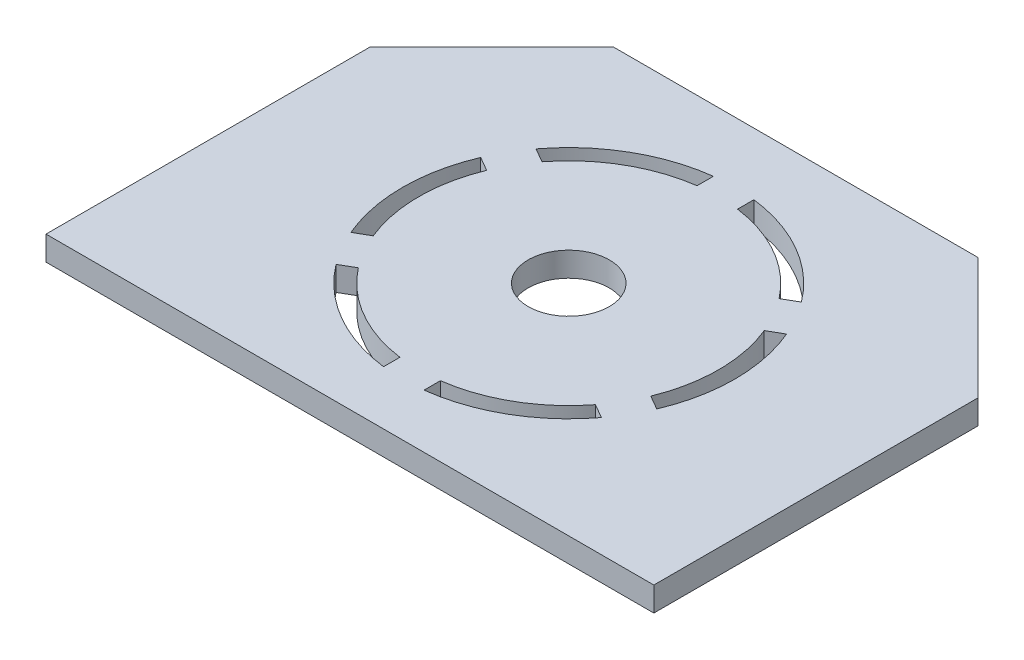
ISO-10303-21;
HEADER;
FILE_DESCRIPTION(('STEP AP214'),'2;1');
FILE_NAME('part.step','',(''),(''),'','','');
FILE_SCHEMA(('AUTOMOTIVE_DESIGN { 1 0 10303 214 1 1 1 1 }'));
ENDSEC;
DATA;
#1=APPLICATION_CONTEXT('core data for automotive mechanical design processes');
#2=APPLICATION_PROTOCOL_DEFINITION('international standard','automotive_design',2000,#1);
#3=PRODUCT_CONTEXT('',#1,'mechanical');
#4=PRODUCT('Part','Part','',(#3));
#5=PRODUCT_RELATED_PRODUCT_CATEGORY('part','',(#4));
#6=PRODUCT_DEFINITION_FORMATION('','',#4);
#7=PRODUCT_DEFINITION_CONTEXT('part definition',#1,'design');
#8=PRODUCT_DEFINITION('design','',#6,#7);
#9=PRODUCT_DEFINITION_SHAPE('','',#8);
#10=(LENGTH_UNIT() NAMED_UNIT(*) SI_UNIT(.MILLI.,.METRE.));
#11=(NAMED_UNIT(*) PLANE_ANGLE_UNIT() SI_UNIT($,.RADIAN.));
#12=(NAMED_UNIT(*) SI_UNIT($,.STERADIAN.) SOLID_ANGLE_UNIT());
#13=UNCERTAINTY_MEASURE_WITH_UNIT(LENGTH_MEASURE(1.E-05),#10,'distance_accuracy_value','');
#14=(GEOMETRIC_REPRESENTATION_CONTEXT(3) GLOBAL_UNCERTAINTY_ASSIGNED_CONTEXT((#13)) GLOBAL_UNIT_ASSIGNED_CONTEXT((#10,
#11,#12)) REPRESENTATION_CONTEXT('',''));
#15=CARTESIAN_POINT('',(0.,0.,0.));
#16=DIRECTION('',(0.,0.,1.));
#17=DIRECTION('',(1.,0.,0.));
#18=AXIS2_PLACEMENT_3D('',#15,#16,#17);
#19=CARTESIAN_POINT('',(20.5682593856655,3.,-26.1552901023891));
#20=DIRECTION('',(0.,-1.,0.));
#21=DIRECTION('',(0.,0.,-1.));
#22=AXIS2_PLACEMENT_3D('',#19,#20,#21);
#23=CYLINDRICAL_SURFACE('',#22,18.5);
#24=CARTESIAN_POINT('',(20.5682593856655,0.,-26.1552901023891));
#25=DIRECTION('',(0.,1.,0.));
#26=DIRECTION('',(0.,0.,1.));
#27=AXIS2_PLACEMENT_3D('',#24,#25,#26);
#28=CIRCLE('',#27,18.5);
#29=CARTESIAN_POINT('',(18.0682593856655,0.,-44.4855928822116));
#30=VERTEX_POINT('',#29);
#31=CARTESIAN_POINT('',(5.94375151927797,0.,-37.4855050017619));
#32=VERTEX_POINT('',#31);
#33=EDGE_CURVE('E60',#30,#32,#28,.T.);
#34=ORIENTED_EDGE('',*,*,#33,.T.);
#35=DIRECTION('',(0.,1.,0.));
#36=VECTOR('',#35,1.);
#37=CARTESIAN_POINT('',(5.94375151927854,0.,-37.4855050017614));
#38=LINE('',#37,#36);
#39=CARTESIAN_POINT('',(5.94375151927797,3.,-37.4855050017619));
#40=VERTEX_POINT('',#39);
#41=EDGE_CURVE('E81',#32,#40,#38,.T.);
#42=ORIENTED_EDGE('',*,*,#41,.T.);
#43=CARTESIAN_POINT('',(20.5682593856655,3.,-26.1552901023891));
#44=DIRECTION('',(0.,1.,0.));
#45=DIRECTION('',(0.,0.,1.));
#46=AXIS2_PLACEMENT_3D('',#43,#44,#45);
#47=CIRCLE('',#46,18.5);
#48=CARTESIAN_POINT('',(18.0682593856655,3.,-44.4855928822124));
#49=VERTEX_POINT('',#48);
#50=EDGE_CURVE('E12',#49,#40,#47,.T.);
#51=ORIENTED_EDGE('',*,*,#50,.F.);
#52=DIRECTION('',(0.,1.,0.));
#53=VECTOR('',#52,1.);
#54=CARTESIAN_POINT('',(18.0682593856655,0.,-44.4855928822116));
#55=LINE('',#54,#53);
#56=EDGE_CURVE('E457',#30,#49,#55,.T.);
#57=ORIENTED_EDGE('',*,*,#56,.F.);
#58=EDGE_LOOP('',(#34,#42,#51,#57));
#59=FACE_BOUND('',#58,.T.);
#60=ADVANCED_FACE('F56',(#59),#23,.T.);
#61=CARTESIAN_POINT('',(20.5682593856655,3.,-26.1552901023891));
#62=DIRECTION('',(0.,-1.,0.));
#63=DIRECTION('',(0.,0.,-1.));
#64=AXIS2_PLACEMENT_3D('',#61,#62,#63);
#65=CYLINDRICAL_SURFACE('',#64,20.5);
#66=DIRECTION('',(0.,1.,0.));
#67=VECTOR('',#66,1.);
#68=CARTESIAN_POINT('',(4.19724919895953,0.,-38.4938485865379));
#69=LINE('',#68,#67);
#70=CARTESIAN_POINT('',(4.19724919895953,0.,-38.4938485865379));
#71=VERTEX_POINT('',#70);
#72=CARTESIAN_POINT('',(4.19724919895953,3.,-38.4938485865379));
#73=VERTEX_POINT('',#72);
#74=EDGE_CURVE('E282',#71,#73,#69,.T.);
#75=ORIENTED_EDGE('',*,*,#74,.F.);
#76=CARTESIAN_POINT('',(20.5682593856655,0.,-26.1552901023891));
#77=DIRECTION('',(0.,1.,0.));
#78=DIRECTION('',(0.,0.,1.));
#79=AXIS2_PLACEMENT_3D('',#76,#77,#78);
#80=CIRCLE('',#79,20.5);
#81=CARTESIAN_POINT('',(18.0682593856655,0.,-46.5022800517649));
#82=VERTEX_POINT('',#81);
#83=EDGE_CURVE('E403',#82,#71,#80,.T.);
#84=ORIENTED_EDGE('',*,*,#83,.F.);
#85=DIRECTION('',(0.,1.,0.));
#86=VECTOR('',#85,1.);
#87=CARTESIAN_POINT('',(18.0682593856655,0.,-46.5022800517649));
#88=LINE('',#87,#86);
#89=CARTESIAN_POINT('',(18.0682593856655,3.,-46.5022800517649));
#90=VERTEX_POINT('',#89);
#91=EDGE_CURVE('E445',#82,#90,#88,.T.);
#92=ORIENTED_EDGE('',*,*,#91,.T.);
#93=CARTESIAN_POINT('',(20.5682593856655,3.,-26.1552901023891));
#94=DIRECTION('',(0.,1.,0.));
#95=DIRECTION('',(0.,0.,1.));
#96=AXIS2_PLACEMENT_3D('',#93,#94,#95);
#97=CIRCLE('',#96,20.5);
#98=EDGE_CURVE('E380',#90,#73,#97,.T.);
#99=ORIENTED_EDGE('',*,*,#98,.T.);
#100=EDGE_LOOP('',(#75,#84,#92,#99));
#101=FACE_BOUND('',#100,.T.);
#102=ADVANCED_FACE('F483',(#101),#65,.F.);
#103=CARTESIAN_POINT('',(3.44375151927794,3.,-33.1553779828396));
#104=VERTEX_POINT('',#103);
#105=CARTESIAN_POINT('',(3.44375151927797,3.,-19.1552022219385));
#106=VERTEX_POINT('',#105);
#107=EDGE_CURVE('E65',#104,#106,#47,.T.);
#108=ORIENTED_EDGE('',*,*,#107,.F.);
#109=DIRECTION('',(0.,1.,0.));
#110=VECTOR('',#109,1.);
#111=CARTESIAN_POINT('',(3.44375151927853,0.,-33.1553779828392));
#112=LINE('',#111,#110);
#113=CARTESIAN_POINT('',(3.44375151927853,0.,-33.1553779828392));
#114=VERTEX_POINT('',#113);
#115=EDGE_CURVE('E264',#114,#104,#112,.T.);
#116=ORIENTED_EDGE('',*,*,#115,.F.);
#117=CARTESIAN_POINT('',(3.44375151927797,0.,-19.1552022219385));
#118=VERTEX_POINT('',#117);
#119=EDGE_CURVE('E254',#114,#118,#28,.T.);
#120=ORIENTED_EDGE('',*,*,#119,.T.);
#121=DIRECTION('',(0.,1.,0.));
#122=VECTOR('',#121,1.);
#123=CARTESIAN_POINT('',(3.44375151927873,0.,-19.1552022219388));
#124=LINE('',#123,#122);
#125=EDGE_CURVE('E301',#118,#106,#124,.T.);
#126=ORIENTED_EDGE('',*,*,#125,.T.);
#127=EDGE_LOOP('',(#108,#116,#120,#126));
#128=FACE_BOUND('',#127,.T.);
#129=ADVANCED_FACE('F265',(#128),#23,.T.);
#130=DIRECTION('',(0.,1.,0.));
#131=VECTOR('',#130,1.);
#132=CARTESIAN_POINT('',(1.69724919895999,0.,-34.1637215676155));
#133=LINE('',#132,#131);
#134=CARTESIAN_POINT('',(1.69724919895939,0.,-34.1637215676158));
#135=VERTEX_POINT('',#134);
#136=CARTESIAN_POINT('',(1.69724919895999,3.,-34.1637215676155));
#137=VERTEX_POINT('',#136);
#138=EDGE_CURVE('E268',#135,#137,#133,.T.);
#139=ORIENTED_EDGE('',*,*,#138,.T.);
#140=CARTESIAN_POINT('',(1.69724919895965,3.,-18.1468586371623));
#141=VERTEX_POINT('',#140);
#142=EDGE_CURVE('E384',#137,#141,#97,.T.);
#143=ORIENTED_EDGE('',*,*,#142,.T.);
#144=DIRECTION('',(0.,1.,0.));
#145=VECTOR('',#144,1.);
#146=CARTESIAN_POINT('',(1.69724919895965,0.,-18.1468586371623));
#147=LINE('',#146,#145);
#148=CARTESIAN_POINT('',(1.69724919895965,0.,-18.1468586371623));
#149=VERTEX_POINT('',#148);
#150=EDGE_CURVE('E297',#149,#141,#147,.T.);
#151=ORIENTED_EDGE('',*,*,#150,.F.);
#152=EDGE_CURVE('E407',#135,#149,#80,.T.);
#153=ORIENTED_EDGE('',*,*,#152,.F.);
#154=EDGE_LOOP('',(#139,#143,#151,#153));
#155=FACE_BOUND('',#154,.T.);
#156=ADVANCED_FACE('F512',(#155),#65,.F.);
#157=CARTESIAN_POINT('',(5.94375151927801,3.,-14.8250752030163));
#158=VERTEX_POINT('',#157);
#159=CARTESIAN_POINT('',(18.0682593856655,3.,-7.82498732256572));
#160=VERTEX_POINT('',#159);
#161=EDGE_CURVE('E551',#158,#160,#47,.T.);
#162=ORIENTED_EDGE('',*,*,#161,.F.);
#163=DIRECTION('',(0.,1.,0.));
#164=VECTOR('',#163,1.);
#165=CARTESIAN_POINT('',(5.94375151927872,0.,-14.8250752030167));
#166=LINE('',#165,#164);
#167=CARTESIAN_POINT('',(5.94375151927872,0.,-14.8250752030167));
#168=VERTEX_POINT('',#167);
#169=EDGE_CURVE('E303',#168,#158,#166,.T.);
#170=ORIENTED_EDGE('',*,*,#169,.F.);
#171=CARTESIAN_POINT('',(18.0682593856655,0.,-7.82498732256572));
#172=VERTEX_POINT('',#171);
#173=EDGE_CURVE('E263',#168,#172,#28,.T.);
#174=ORIENTED_EDGE('',*,*,#173,.T.);
#175=DIRECTION('',(0.,1.,0.));
#176=VECTOR('',#175,1.);
#177=CARTESIAN_POINT('',(18.0682593856656,0.,-7.82498732256652));
#178=LINE('',#177,#176);
#179=EDGE_CURVE('E324',#172,#160,#178,.T.);
#180=ORIENTED_EDGE('',*,*,#179,.T.);
#181=EDGE_LOOP('',(#162,#170,#174,#180));
#182=FACE_BOUND('',#181,.T.);
#183=ADVANCED_FACE('F516',(#182),#23,.T.);
#184=DIRECTION('',(0.,1.,0.));
#185=VECTOR('',#184,1.);
#186=CARTESIAN_POINT('',(4.19724919895968,0.,-13.8167316182401));
#187=LINE('',#186,#185);
#188=CARTESIAN_POINT('',(4.19724919895949,0.,-13.81673161824));
#189=VERTEX_POINT('',#188);
#190=CARTESIAN_POINT('',(4.19724919895968,3.,-13.8167316182401));
#191=VERTEX_POINT('',#190);
#192=EDGE_CURVE('E292',#189,#191,#187,.T.);
#193=ORIENTED_EDGE('',*,*,#192,.T.);
#194=CARTESIAN_POINT('',(18.0682593856656,3.,-5.80830015301347));
#195=VERTEX_POINT('',#194);
#196=EDGE_CURVE('E561',#191,#195,#97,.T.);
#197=ORIENTED_EDGE('',*,*,#196,.T.);
#198=DIRECTION('',(0.,1.,0.));
#199=VECTOR('',#198,1.);
#200=CARTESIAN_POINT('',(18.0682593856656,0.,-5.80830015301347));
#201=LINE('',#200,#199);
#202=CARTESIAN_POINT('',(18.0682593856656,0.,-5.80830015301347));
#203=VERTEX_POINT('',#202);
#204=EDGE_CURVE('E320',#203,#195,#201,.T.);
#205=ORIENTED_EDGE('',*,*,#204,.F.);
#206=EDGE_CURVE('E586',#189,#203,#80,.T.);
#207=ORIENTED_EDGE('',*,*,#206,.F.);
#208=EDGE_LOOP('',(#193,#197,#205,#207));
#209=FACE_BOUND('',#208,.T.);
#210=ADVANCED_FACE('F537',(#209),#65,.F.);
#211=CARTESIAN_POINT('',(23.0682593856656,3.,-7.82498732256572));
#212=VERTEX_POINT('',#211);
#213=CARTESIAN_POINT('',(35.1927672520531,3.,-14.8250752030163));
#214=VERTEX_POINT('',#213);
#215=EDGE_CURVE('E555',#212,#214,#47,.T.);
#216=ORIENTED_EDGE('',*,*,#215,.F.);
#217=DIRECTION('',(0.,1.,0.));
#218=VECTOR('',#217,1.);
#219=CARTESIAN_POINT('',(23.0682593856656,0.,-7.82498732256654));
#220=LINE('',#219,#218);
#221=CARTESIAN_POINT('',(23.0682593856656,0.,-7.82498732256654));
#222=VERTEX_POINT('',#221);
#223=EDGE_CURVE('E327',#222,#212,#220,.T.);
#224=ORIENTED_EDGE('',*,*,#223,.F.);
#225=CARTESIAN_POINT('',(35.1927672520531,0.,-14.8250752030163));
#226=VERTEX_POINT('',#225);
#227=EDGE_CURVE('E472',#222,#226,#28,.T.);
#228=ORIENTED_EDGE('',*,*,#227,.T.);
#229=DIRECTION('',(0.,1.,0.));
#230=VECTOR('',#229,1.);
#231=CARTESIAN_POINT('',(35.1927672520524,0.,-14.8250752030168));
#232=LINE('',#231,#230);
#233=EDGE_CURVE('E348',#226,#214,#232,.T.);
#234=ORIENTED_EDGE('',*,*,#233,.T.);
#235=EDGE_LOOP('',(#216,#224,#228,#234));
#236=FACE_BOUND('',#235,.T.);
#237=ADVANCED_FACE('F531',(#236),#23,.T.);
#238=DIRECTION('',(0.,1.,0.));
#239=VECTOR('',#238,1.);
#240=CARTESIAN_POINT('',(23.0682593856656,0.,-5.80830015301349));
#241=LINE('',#240,#239);
#242=CARTESIAN_POINT('',(23.0682593856656,0.,-5.80830015301328));
#243=VERTEX_POINT('',#242);
#244=CARTESIAN_POINT('',(23.0682593856656,3.,-5.80830015301349));
#245=VERTEX_POINT('',#244);
#246=EDGE_CURVE('E315',#243,#245,#241,.T.);
#247=ORIENTED_EDGE('',*,*,#246,.T.);
#248=CARTESIAN_POINT('',(36.9392695723715,3.,-13.8167316182403));
#249=VERTEX_POINT('',#248);
#250=EDGE_CURVE('E563',#245,#249,#97,.T.);
#251=ORIENTED_EDGE('',*,*,#250,.T.);
#252=DIRECTION('',(0.,1.,0.));
#253=VECTOR('',#252,1.);
#254=CARTESIAN_POINT('',(36.9392695723715,0.,-13.8167316182403));
#255=LINE('',#254,#253);
#256=CARTESIAN_POINT('',(36.9392695723715,0.,-13.8167316182403));
#257=VERTEX_POINT('',#256);
#258=EDGE_CURVE('E344',#257,#249,#255,.T.);
#259=ORIENTED_EDGE('',*,*,#258,.F.);
#260=EDGE_CURVE('E582',#243,#257,#80,.T.);
#261=ORIENTED_EDGE('',*,*,#260,.F.);
#262=EDGE_LOOP('',(#247,#251,#259,#261));
#263=FACE_BOUND('',#262,.T.);
#264=ADVANCED_FACE('F529',(#263),#65,.F.);
#265=CARTESIAN_POINT('',(37.6927672520531,3.,-19.1552022219385));
#266=VERTEX_POINT('',#265);
#267=CARTESIAN_POINT('',(37.6927672520531,3.,-33.1553779828397));
#268=VERTEX_POINT('',#267);
#269=EDGE_CURVE('E577',#266,#268,#47,.T.);
#270=ORIENTED_EDGE('',*,*,#269,.F.);
#271=DIRECTION('',(0.,1.,0.));
#272=VECTOR('',#271,1.);
#273=CARTESIAN_POINT('',(37.6927672520524,0.,-19.1552022219389));
#274=LINE('',#273,#272);
#275=CARTESIAN_POINT('',(37.6927672520524,0.,-19.1552022219389));
#276=VERTEX_POINT('',#275);
#277=EDGE_CURVE('E351',#276,#266,#274,.T.);
#278=ORIENTED_EDGE('',*,*,#277,.F.);
#279=CARTESIAN_POINT('',(37.6927672520531,0.,-33.1553779828397));
#280=VERTEX_POINT('',#279);
#281=EDGE_CURVE('E468',#276,#280,#28,.T.);
#282=ORIENTED_EDGE('',*,*,#281,.T.);
#283=DIRECTION('',(0.,1.,0.));
#284=VECTOR('',#283,1.);
#285=CARTESIAN_POINT('',(37.6927672520523,0.,-33.1553779828393));
#286=LINE('',#285,#284);
#287=EDGE_CURVE('E372',#280,#268,#286,.T.);
#288=ORIENTED_EDGE('',*,*,#287,.T.);
#289=EDGE_LOOP('',(#270,#278,#282,#288));
#290=FACE_BOUND('',#289,.T.);
#291=ADVANCED_FACE('F518',(#290),#23,.T.);
#292=DIRECTION('',(0.,1.,0.));
#293=VECTOR('',#292,1.);
#294=CARTESIAN_POINT('',(39.4392695723715,0.,-18.1468586371625));
#295=LINE('',#294,#293);
#296=CARTESIAN_POINT('',(39.4392695723717,0.,-18.1468586371624));
#297=VERTEX_POINT('',#296);
#298=CARTESIAN_POINT('',(39.4392695723715,3.,-18.1468586371625));
#299=VERTEX_POINT('',#298);
#300=EDGE_CURVE('E339',#297,#299,#295,.T.);
#301=ORIENTED_EDGE('',*,*,#300,.T.);
#302=CARTESIAN_POINT('',(39.4392695723716,3.,-34.163721567616));
#303=VERTEX_POINT('',#302);
#304=EDGE_CURVE('E564',#299,#303,#97,.T.);
#305=ORIENTED_EDGE('',*,*,#304,.T.);
#306=DIRECTION('',(0.,1.,0.));
#307=VECTOR('',#306,1.);
#308=CARTESIAN_POINT('',(39.4392695723714,0.,-34.1637215676159));
#309=LINE('',#308,#307);
#310=CARTESIAN_POINT('',(39.4392695723716,0.,-34.163721567616));
#311=VERTEX_POINT('',#310);
#312=EDGE_CURVE('E368',#311,#303,#309,.T.);
#313=ORIENTED_EDGE('',*,*,#312,.F.);
#314=EDGE_CURVE('E581',#297,#311,#80,.T.);
#315=ORIENTED_EDGE('',*,*,#314,.F.);
#316=EDGE_LOOP('',(#301,#305,#313,#315));
#317=FACE_BOUND('',#316,.T.);
#318=ADVANCED_FACE('F526',(#317),#65,.F.);
#319=CARTESIAN_POINT('',(20.5682593856655,3.,-26.1552901023891));
#320=DIRECTION('',(0.,-1.,0.));
#321=DIRECTION('',(0.,0.,-1.));
#322=AXIS2_PLACEMENT_3D('',#319,#320,#321);
#323=CYLINDRICAL_SURFACE('',#322,5.);
#324=CARTESIAN_POINT('',(20.5682593856655,3.,-26.1552901023891));
#325=DIRECTION('',(0.,1.,0.));
#326=DIRECTION('',(0.,0.,1.));
#327=AXIS2_PLACEMENT_3D('',#324,#325,#326);
#328=CIRCLE('',#327,5.);
#329=CARTESIAN_POINT('',(20.5682593856655,3.,-21.1552901023891));
#330=VERTEX_POINT('',#329);
#331=EDGE_CURVE('E462',#330,#330,#328,.T.);
#332=ORIENTED_EDGE('',*,*,#331,.T.);
#333=EDGE_LOOP('',(#332));
#334=FACE_BOUND('',#333,.T.);
#335=CARTESIAN_POINT('',(20.5682593856655,0.,-26.1552901023891));
#336=DIRECTION('',(0.,1.,0.));
#337=DIRECTION('',(0.,0.,1.));
#338=AXIS2_PLACEMENT_3D('',#335,#336,#337);
#339=CIRCLE('',#338,5.);
#340=CARTESIAN_POINT('',(20.5682593856655,0.,-21.1552901023891));
#341=VERTEX_POINT('',#340);
#342=EDGE_CURVE('E453',#341,#341,#339,.T.);
#343=ORIENTED_EDGE('',*,*,#342,.F.);
#344=EDGE_LOOP('',(#343));
#345=FACE_BOUND('',#344,.T.);
#346=ADVANCED_FACE('F58',(#334,#345),#323,.F.);
#347=CARTESIAN_POINT('',(35.192767252053,3.,-37.4855050017619));
#348=VERTEX_POINT('',#347);
#349=CARTESIAN_POINT('',(23.0682593856655,3.,-44.4855928822124));
#350=VERTEX_POINT('',#349);
#351=EDGE_CURVE('E67',#348,#350,#47,.T.);
#352=ORIENTED_EDGE('',*,*,#351,.F.);
#353=DIRECTION('',(0.,1.,0.));
#354=VECTOR('',#353,1.);
#355=CARTESIAN_POINT('',(35.1927672520523,0.,-37.4855050017615));
#356=LINE('',#355,#354);
#357=CARTESIAN_POINT('',(35.1927672520523,0.,-37.4855050017615));
#358=VERTEX_POINT('',#357);
#359=EDGE_CURVE('E375',#358,#348,#356,.T.);
#360=ORIENTED_EDGE('',*,*,#359,.F.);
#361=CARTESIAN_POINT('',(23.0682593856655,0.,-44.4855928822124));
#362=VERTEX_POINT('',#361);
#363=EDGE_CURVE('E465',#358,#362,#28,.T.);
#364=ORIENTED_EDGE('',*,*,#363,.T.);
#365=DIRECTION('',(0.,1.,0.));
#366=VECTOR('',#365,1.);
#367=CARTESIAN_POINT('',(23.0682593856654,0.,-44.4855928822116));
#368=LINE('',#367,#366);
#369=EDGE_CURVE('E454',#362,#350,#368,.T.);
#370=ORIENTED_EDGE('',*,*,#369,.T.);
#371=EDGE_LOOP('',(#352,#360,#364,#370));
#372=FACE_BOUND('',#371,.T.);
#373=ADVANCED_FACE('F506',(#372),#23,.T.);
#374=CARTESIAN_POINT('',(0.,3.,0.));
#375=DIRECTION('',(0.,1.,0.));
#376=DIRECTION('',(0.,0.,1.));
#377=AXIS2_PLACEMENT_3D('',#374,#375,#376);
#378=PLANE('',#377);
#379=ORIENTED_EDGE('',*,*,#142,.F.);
#380=DIRECTION('',(0.866025403784436,0.,0.500000000000005));
#381=VECTOR('',#380,1.);
#382=CARTESIAN_POINT('',(3.44375151927853,3.,-33.1553779828392));
#383=LINE('',#382,#381);
#384=EDGE_CURVE('E278',#137,#104,#383,.T.);
#385=ORIENTED_EDGE('',*,*,#384,.T.);
#386=ORIENTED_EDGE('',*,*,#107,.T.);
#387=DIRECTION('',(-0.866025403784438,0.,0.500000000000001));
#388=VECTOR('',#387,1.);
#389=CARTESIAN_POINT('',(3.44375151927873,3.,-19.1552022219388));
#390=LINE('',#389,#388);
#391=EDGE_CURVE('E290',#106,#141,#390,.T.);
#392=ORIENTED_EDGE('',*,*,#391,.T.);
#393=EDGE_LOOP('',(#379,#385,#386,#392));
#394=FACE_BOUND('',#393,.T.);
#395=ORIENTED_EDGE('',*,*,#196,.F.);
#396=DIRECTION('',(0.866025403784424,0.,-0.500000000000026));
#397=VECTOR('',#396,1.);
#398=CARTESIAN_POINT('',(5.94375151927872,3.,-14.8250752030167));
#399=LINE('',#398,#397);
#400=EDGE_CURVE('E284',#191,#158,#399,.T.);
#401=ORIENTED_EDGE('',*,*,#400,.T.);
#402=ORIENTED_EDGE('',*,*,#161,.T.);
#403=DIRECTION('',(0.,0.,1.));
#404=VECTOR('',#403,1.);
#405=CARTESIAN_POINT('',(18.0682593856656,3.,-7.82498732256653));
#406=LINE('',#405,#404);
#407=EDGE_CURVE('E312',#160,#195,#406,.T.);
#408=ORIENTED_EDGE('',*,*,#407,.T.);
#409=EDGE_LOOP('',(#395,#401,#402,#408));
#410=FACE_BOUND('',#409,.T.);
#411=ORIENTED_EDGE('',*,*,#250,.F.);
#412=DIRECTION('',(0.,0.,-1.));
#413=VECTOR('',#412,1.);
#414=CARTESIAN_POINT('',(23.0682593856656,3.,-7.82498732256654));
#415=LINE('',#414,#413);
#416=EDGE_CURVE('E300',#245,#212,#415,.T.);
#417=ORIENTED_EDGE('',*,*,#416,.T.);
#418=ORIENTED_EDGE('',*,*,#215,.T.);
#419=DIRECTION('',(0.866025403784439,0.,0.5));
#420=VECTOR('',#419,1.);
#421=CARTESIAN_POINT('',(35.1927672520524,3.,-14.8250752030168));
#422=LINE('',#421,#420);
#423=EDGE_CURVE('E336',#214,#249,#422,.T.);
#424=ORIENTED_EDGE('',*,*,#423,.T.);
#425=EDGE_LOOP('',(#411,#417,#418,#424));
#426=FACE_BOUND('',#425,.T.);
#427=ORIENTED_EDGE('',*,*,#304,.F.);
#428=DIRECTION('',(-0.866025403784452,0.,-0.499999999999976));
#429=VECTOR('',#428,1.);
#430=CARTESIAN_POINT('',(37.6927672520524,3.,-19.1552022219389));
#431=LINE('',#430,#429);
#432=EDGE_CURVE('E323',#299,#266,#431,.T.);
#433=ORIENTED_EDGE('',*,*,#432,.T.);
#434=ORIENTED_EDGE('',*,*,#269,.T.);
#435=DIRECTION('',(0.866025403784438,0.,-0.500000000000002));
#436=VECTOR('',#435,1.);
#437=CARTESIAN_POINT('',(37.6927672520523,3.,-33.1553779828393));
#438=LINE('',#437,#436);
#439=EDGE_CURVE('E360',#268,#303,#438,.T.);
#440=ORIENTED_EDGE('',*,*,#439,.T.);
#441=EDGE_LOOP('',(#427,#433,#434,#440));
#442=FACE_BOUND('',#441,.T.);
#443=ORIENTED_EDGE('',*,*,#50,.T.);
#444=DIRECTION('',(-0.866025403784444,0.,-0.499999999999991));
#445=VECTOR('',#444,1.);
#446=CARTESIAN_POINT('',(5.94375151927857,3.,-37.4855050017614));
#447=LINE('',#446,#445);
#448=EDGE_CURVE('E274',#40,#73,#447,.T.);
#449=ORIENTED_EDGE('',*,*,#448,.T.);
#450=ORIENTED_EDGE('',*,*,#98,.F.);
#451=DIRECTION('',(0.,0.,1.));
#452=VECTOR('',#451,1.);
#453=CARTESIAN_POINT('',(18.0682593856655,3.,-44.4855928822116));
#454=LINE('',#453,#452);
#455=EDGE_CURVE('E437',#90,#49,#454,.T.);
#456=ORIENTED_EDGE('',*,*,#455,.T.);
#457=EDGE_LOOP('',(#443,#449,#450,#456));
#458=FACE_BOUND('',#457,.T.);
#459=ORIENTED_EDGE('',*,*,#331,.F.);
#460=EDGE_LOOP('',(#459));
#461=FACE_BOUND('',#460,.T.);
#462=DIRECTION('',(-0.866025403784425,0.,0.500000000000023));
#463=VECTOR('',#462,1.);
#464=CARTESIAN_POINT('',(35.1927672520523,3.,-37.4855050017615));
#465=LINE('',#464,#463);
#466=CARTESIAN_POINT('',(36.9392695723714,3.,-38.493848586538));
#467=VERTEX_POINT('',#466);
#468=EDGE_CURVE('E347',#467,#348,#465,.T.);
#469=ORIENTED_EDGE('',*,*,#468,.T.);
#470=ORIENTED_EDGE('',*,*,#351,.T.);
#471=DIRECTION('',(0.,0.,-1.));
#472=VECTOR('',#471,1.);
#473=CARTESIAN_POINT('',(23.0682593856654,3.,-44.4855928822116));
#474=LINE('',#473,#472);
#475=CARTESIAN_POINT('',(23.0682593856655,3.,-46.5022800517649));
#476=VERTEX_POINT('',#475);
#477=EDGE_CURVE('E442',#350,#476,#474,.T.);
#478=ORIENTED_EDGE('',*,*,#477,.T.);
#479=EDGE_CURVE('E385',#467,#476,#97,.T.);
#480=ORIENTED_EDGE('',*,*,#479,.F.);
#481=EDGE_LOOP('',(#469,#470,#478,#480));
#482=FACE_BOUND('',#481,.T.);
#483=DIRECTION('',(0.707106781186548,0.,0.707106781186548));
#484=VECTOR('',#483,1.);
#485=CARTESIAN_POINT('',(48.6117747440273,3.,-48.6117747440273));
#486=LINE('',#485,#484);
#487=CARTESIAN_POINT('',(43.0682593856655,3.,-54.1552901023891));
#488=VERTEX_POINT('',#487);
#489=CARTESIAN_POINT('',(58.0682593856655,3.,-39.1552901023891));
#490=VERTEX_POINT('',#489);
#491=EDGE_CURVE('E383',#488,#490,#486,.T.);
#492=ORIENTED_EDGE('',*,*,#491,.F.);
#493=DIRECTION('',(1.,0.,0.));
#494=VECTOR('',#493,1.);
#495=CARTESIAN_POINT('',(0.,3.,-54.1552901023891));
#496=LINE('',#495,#494);
#497=CARTESIAN_POINT('',(-1.93174061433449,3.,-54.1552901023891));
#498=VERTEX_POINT('',#497);
#499=EDGE_CURVE('E388',#498,#488,#496,.T.);
#500=ORIENTED_EDGE('',*,*,#499,.F.);
#501=DIRECTION('',(0.707106781186547,0.,-0.707106781186548));
#502=VECTOR('',#501,1.);
#503=CARTESIAN_POINT('',(-28.0435153583618,3.,-28.0435153583618));
#504=LINE('',#503,#502);
#505=CARTESIAN_POINT('',(-16.9317406143345,3.,-39.1552901023891));
#506=VERTEX_POINT('',#505);
#507=EDGE_CURVE('E391',#506,#498,#504,.T.);
#508=ORIENTED_EDGE('',*,*,#507,.F.);
#509=DIRECTION('',(0.,0.,1.));
#510=VECTOR('',#509,1.);
#511=CARTESIAN_POINT('',(-16.9317406143345,3.,0.));
#512=LINE('',#511,#510);
#513=CARTESIAN_POINT('',(-16.9317406143345,3.,0.844709897610922));
#514=VERTEX_POINT('',#513);
#515=EDGE_CURVE('E394',#506,#514,#512,.T.);
#516=ORIENTED_EDGE('',*,*,#515,.T.);
#517=DIRECTION('',(1.,0.,0.));
#518=VECTOR('',#517,1.);
#519=CARTESIAN_POINT('',(0.,3.,0.844709897610922));
#520=LINE('',#519,#518);
#521=CARTESIAN_POINT('',(58.0682593856655,3.,0.844709897610922));
#522=VERTEX_POINT('',#521);
#523=EDGE_CURVE('E397',#514,#522,#520,.T.);
#524=ORIENTED_EDGE('',*,*,#523,.T.);
#525=DIRECTION('',(0.,0.,1.));
#526=VECTOR('',#525,1.);
#527=CARTESIAN_POINT('',(58.0682593856655,3.,0.));
#528=LINE('',#527,#526);
#529=EDGE_CURVE('E399',#490,#522,#528,.T.);
#530=ORIENTED_EDGE('',*,*,#529,.F.);
#531=EDGE_LOOP('',(#492,#500,#508,#516,#524,#530));
#532=FACE_BOUND('',#531,.T.);
#533=ADVANCED_FACE('F486',(#394,#410,#426,#442,#458,#461,#482,#532),#378,.T.);
#534=CARTESIAN_POINT('',(0.,0.,0.));
#535=DIRECTION('',(0.,1.,0.));
#536=DIRECTION('',(0.,0.,1.));
#537=AXIS2_PLACEMENT_3D('',#534,#535,#536);
#538=PLANE('',#537);
#539=DIRECTION('',(0.866025403784436,0.,0.500000000000005));
#540=VECTOR('',#539,1.);
#541=CARTESIAN_POINT('',(3.44375151927853,0.,-33.1553779828392));
#542=LINE('',#541,#540);
#543=EDGE_CURVE('E258',#135,#114,#542,.T.);
#544=ORIENTED_EDGE('',*,*,#543,.F.);
#545=ORIENTED_EDGE('',*,*,#152,.T.);
#546=DIRECTION('',(-0.866025403784438,0.,0.500000000000001));
#547=VECTOR('',#546,1.);
#548=CARTESIAN_POINT('',(3.44375151927873,0.,-19.1552022219388));
#549=LINE('',#548,#547);
#550=EDGE_CURVE('E261',#118,#149,#549,.T.);
#551=ORIENTED_EDGE('',*,*,#550,.F.);
#552=ORIENTED_EDGE('',*,*,#119,.F.);
#553=EDGE_LOOP('',(#544,#545,#551,#552));
#554=FACE_BOUND('',#553,.T.);
#555=DIRECTION('',(0.866025403784424,0.,-0.500000000000026));
#556=VECTOR('',#555,1.);
#557=CARTESIAN_POINT('',(5.94375151927872,0.,-14.8250752030167));
#558=LINE('',#557,#556);
#559=EDGE_CURVE('E287',#189,#168,#558,.T.);
#560=ORIENTED_EDGE('',*,*,#559,.F.);
#561=ORIENTED_EDGE('',*,*,#206,.T.);
#562=DIRECTION('',(0.,0.,1.));
#563=VECTOR('',#562,1.);
#564=CARTESIAN_POINT('',(18.0682593856656,0.,-7.82498732256653));
#565=LINE('',#564,#563);
#566=EDGE_CURVE('E311',#172,#203,#565,.T.);
#567=ORIENTED_EDGE('',*,*,#566,.F.);
#568=ORIENTED_EDGE('',*,*,#173,.F.);
#569=EDGE_LOOP('',(#560,#561,#567,#568));
#570=FACE_BOUND('',#569,.T.);
#571=DIRECTION('',(0.,0.,-1.));
#572=VECTOR('',#571,1.);
#573=CARTESIAN_POINT('',(23.0682593856656,0.,-7.82498732256654));
#574=LINE('',#573,#572);
#575=EDGE_CURVE('E308',#243,#222,#574,.T.);
#576=ORIENTED_EDGE('',*,*,#575,.F.);
#577=ORIENTED_EDGE('',*,*,#260,.T.);
#578=DIRECTION('',(0.866025403784439,0.,0.5));
#579=VECTOR('',#578,1.);
#580=CARTESIAN_POINT('',(35.1927672520524,0.,-14.8250752030168));
#581=LINE('',#580,#579);
#582=EDGE_CURVE('E335',#226,#257,#581,.T.);
#583=ORIENTED_EDGE('',*,*,#582,.F.);
#584=ORIENTED_EDGE('',*,*,#227,.F.);
#585=EDGE_LOOP('',(#576,#577,#583,#584));
#586=FACE_BOUND('',#585,.T.);
#587=DIRECTION('',(-0.866025403784452,0.,-0.499999999999976));
#588=VECTOR('',#587,1.);
#589=CARTESIAN_POINT('',(37.6927672520524,0.,-19.1552022219389));
#590=LINE('',#589,#588);
#591=EDGE_CURVE('E332',#297,#276,#590,.T.);
#592=ORIENTED_EDGE('',*,*,#591,.F.);
#593=ORIENTED_EDGE('',*,*,#314,.T.);
#594=DIRECTION('',(0.866025403784438,0.,-0.500000000000002));
#595=VECTOR('',#594,1.);
#596=CARTESIAN_POINT('',(37.6927672520523,0.,-33.1553779828393));
#597=LINE('',#596,#595);
#598=EDGE_CURVE('E359',#280,#311,#597,.T.);
#599=ORIENTED_EDGE('',*,*,#598,.F.);
#600=ORIENTED_EDGE('',*,*,#281,.F.);
#601=EDGE_LOOP('',(#592,#593,#599,#600));
#602=FACE_BOUND('',#601,.T.);
#603=ORIENTED_EDGE('',*,*,#83,.T.);
#604=DIRECTION('',(-0.866025403784444,0.,-0.499999999999991));
#605=VECTOR('',#604,1.);
#606=CARTESIAN_POINT('',(5.94375151927857,0.,-37.4855050017614));
#607=LINE('',#606,#605);
#608=EDGE_CURVE('E273',#32,#71,#607,.T.);
#609=ORIENTED_EDGE('',*,*,#608,.F.);
#610=ORIENTED_EDGE('',*,*,#33,.F.);
#611=DIRECTION('',(0.,0.,1.));
#612=VECTOR('',#611,1.);
#613=CARTESIAN_POINT('',(18.0682593856655,0.,-44.4855928822116));
#614=LINE('',#613,#612);
#615=EDGE_CURVE('E438',#82,#30,#614,.T.);
#616=ORIENTED_EDGE('',*,*,#615,.F.);
#617=EDGE_LOOP('',(#603,#609,#610,#616));
#618=FACE_BOUND('',#617,.T.);
#619=ORIENTED_EDGE('',*,*,#342,.T.);
#620=EDGE_LOOP('',(#619));
#621=FACE_BOUND('',#620,.T.);
#622=ORIENTED_EDGE('',*,*,#363,.F.);
#623=DIRECTION('',(-0.866025403784425,0.,0.500000000000023));
#624=VECTOR('',#623,1.);
#625=CARTESIAN_POINT('',(35.1927672520523,0.,-37.4855050017615));
#626=LINE('',#625,#624);
#627=CARTESIAN_POINT('',(36.9392695723715,0.,-38.4938485865382));
#628=VERTEX_POINT('',#627);
#629=EDGE_CURVE('E356',#628,#358,#626,.T.);
#630=ORIENTED_EDGE('',*,*,#629,.F.);
#631=CARTESIAN_POINT('',(23.0682593856655,0.,-46.5022800517649));
#632=VERTEX_POINT('',#631);
#633=EDGE_CURVE('E371',#628,#632,#80,.T.);
#634=ORIENTED_EDGE('',*,*,#633,.T.);
#635=DIRECTION('',(0.,0.,-1.));
#636=VECTOR('',#635,1.);
#637=CARTESIAN_POINT('',(23.0682593856654,0.,-44.4855928822116));
#638=LINE('',#637,#636);
#639=EDGE_CURVE('E441',#362,#632,#638,.T.);
#640=ORIENTED_EDGE('',*,*,#639,.F.);
#641=EDGE_LOOP('',(#622,#630,#634,#640));
#642=FACE_BOUND('',#641,.T.);
#643=DIRECTION('',(0.707106781186548,0.,0.707106781186548));
#644=VECTOR('',#643,1.);
#645=CARTESIAN_POINT('',(48.6117747440273,0.,-48.6117747440273));
#646=LINE('',#645,#644);
#647=CARTESIAN_POINT('',(43.0682593856655,0.,-54.1552901023891));
#648=VERTEX_POINT('',#647);
#649=CARTESIAN_POINT('',(58.0682593856655,0.,-39.1552901023891));
#650=VERTEX_POINT('',#649);
#651=EDGE_CURVE('E406',#648,#650,#646,.T.);
#652=ORIENTED_EDGE('',*,*,#651,.T.);
#653=DIRECTION('',(0.,0.,1.));
#654=VECTOR('',#653,1.);
#655=CARTESIAN_POINT('',(58.0682593856655,0.,0.));
#656=LINE('',#655,#654);
#657=CARTESIAN_POINT('',(58.0682593856655,0.,0.844709897610922));
#658=VERTEX_POINT('',#657);
#659=EDGE_CURVE('E422',#650,#658,#656,.T.);
#660=ORIENTED_EDGE('',*,*,#659,.T.);
#661=DIRECTION('',(1.,0.,0.));
#662=VECTOR('',#661,1.);
#663=CARTESIAN_POINT('',(0.,0.,0.844709897610922));
#664=LINE('',#663,#662);
#665=CARTESIAN_POINT('',(-16.9317406143345,0.,0.844709897610922));
#666=VERTEX_POINT('',#665);
#667=EDGE_CURVE('E419',#666,#658,#664,.T.);
#668=ORIENTED_EDGE('',*,*,#667,.F.);
#669=DIRECTION('',(0.,0.,1.));
#670=VECTOR('',#669,1.);
#671=CARTESIAN_POINT('',(-16.9317406143345,0.,0.));
#672=LINE('',#671,#670);
#673=CARTESIAN_POINT('',(-16.9317406143345,0.,-39.1552901023891));
#674=VERTEX_POINT('',#673);
#675=EDGE_CURVE('E416',#674,#666,#672,.T.);
#676=ORIENTED_EDGE('',*,*,#675,.F.);
#677=DIRECTION('',(0.707106781186547,0.,-0.707106781186548));
#678=VECTOR('',#677,1.);
#679=CARTESIAN_POINT('',(-28.0435153583618,0.,-28.0435153583618));
#680=LINE('',#679,#678);
#681=CARTESIAN_POINT('',(-1.93174061433449,0.,-54.1552901023891));
#682=VERTEX_POINT('',#681);
#683=EDGE_CURVE('E413',#674,#682,#680,.T.);
#684=ORIENTED_EDGE('',*,*,#683,.T.);
#685=DIRECTION('',(1.,0.,0.));
#686=VECTOR('',#685,1.);
#687=CARTESIAN_POINT('',(0.,0.,-54.1552901023891));
#688=LINE('',#687,#686);
#689=EDGE_CURVE('E410',#682,#648,#688,.T.);
#690=ORIENTED_EDGE('',*,*,#689,.T.);
#691=EDGE_LOOP('',(#652,#660,#668,#676,#684,#690));
#692=FACE_BOUND('',#691,.T.);
#693=ADVANCED_FACE('F255',(#554,#570,#586,#602,#618,#621,#642,#692),#538,.F.);
#694=CARTESIAN_POINT('',(23.0682593856654,0.,-44.4855928822116));
#695=DIRECTION('',(1.,0.,0.));
#696=DIRECTION('',(0.,0.,-1.));
#697=AXIS2_PLACEMENT_3D('',#694,#695,#696);
#698=PLANE('',#697);
#699=ORIENTED_EDGE('',*,*,#477,.F.);
#700=ORIENTED_EDGE('',*,*,#369,.F.);
#701=ORIENTED_EDGE('',*,*,#639,.T.);
#702=DIRECTION('',(0.,1.,0.));
#703=VECTOR('',#702,1.);
#704=CARTESIAN_POINT('',(23.0682593856655,0.,-46.5022800517649));
#705=LINE('',#704,#703);
#706=EDGE_CURVE('E450',#632,#476,#705,.T.);
#707=ORIENTED_EDGE('',*,*,#706,.T.);
#708=EDGE_LOOP('',(#699,#700,#701,#707));
#709=FACE_BOUND('',#708,.T.);
#710=ADVANCED_FACE('F492',(#709),#698,.T.);
#711=CARTESIAN_POINT('',(18.0682593856655,0.,-44.4855928822116));
#712=DIRECTION('',(-1.,0.,0.));
#713=DIRECTION('',(0.,0.,1.));
#714=AXIS2_PLACEMENT_3D('',#711,#712,#713);
#715=PLANE('',#714);
#716=ORIENTED_EDGE('',*,*,#455,.F.);
#717=ORIENTED_EDGE('',*,*,#91,.F.);
#718=ORIENTED_EDGE('',*,*,#615,.T.);
#719=ORIENTED_EDGE('',*,*,#56,.T.);
#720=EDGE_LOOP('',(#716,#717,#718,#719));
#721=FACE_BOUND('',#720,.T.);
#722=ADVANCED_FACE('F489',(#721),#715,.T.);
#723=CARTESIAN_POINT('',(48.6117747440273,3.,-48.6117747440273));
#724=DIRECTION('',(0.707106781186547,0.,-0.707106781186547));
#725=DIRECTION('',(-0.707106781186548,0.,-0.707106781186548));
#726=AXIS2_PLACEMENT_3D('',#723,#724,#725);
#727=PLANE('',#726);
#728=ORIENTED_EDGE('',*,*,#651,.F.);
#729=DIRECTION('',(0.,-1.,0.));
#730=VECTOR('',#729,1.);
#731=CARTESIAN_POINT('',(43.0682593856655,3.,-54.1552901023891));
#732=LINE('',#731,#730);
#733=EDGE_CURVE('E435',#488,#648,#732,.T.);
#734=ORIENTED_EDGE('',*,*,#733,.F.);
#735=ORIENTED_EDGE('',*,*,#491,.T.);
#736=DIRECTION('',(0.,-1.,0.));
#737=VECTOR('',#736,1.);
#738=CARTESIAN_POINT('',(58.0682593856655,3.,-39.1552901023891));
#739=LINE('',#738,#737);
#740=EDGE_CURVE('E402',#490,#650,#739,.T.);
#741=ORIENTED_EDGE('',*,*,#740,.T.);
#742=EDGE_LOOP('',(#728,#734,#735,#741));
#743=FACE_BOUND('',#742,.T.);
#744=ADVANCED_FACE('F491',(#743),#727,.T.);
#745=CARTESIAN_POINT('',(0.,3.,-54.1552901023891));
#746=DIRECTION('',(0.,0.,-1.));
#747=DIRECTION('',(-1.,0.,0.));
#748=AXIS2_PLACEMENT_3D('',#745,#746,#747);
#749=PLANE('',#748);
#750=ORIENTED_EDGE('',*,*,#689,.F.);
#751=DIRECTION('',(0.,-1.,0.));
#752=VECTOR('',#751,1.);
#753=CARTESIAN_POINT('',(-1.93174061433449,3.,-54.1552901023891));
#754=LINE('',#753,#752);
#755=EDGE_CURVE('E433',#498,#682,#754,.T.);
#756=ORIENTED_EDGE('',*,*,#755,.F.);
#757=ORIENTED_EDGE('',*,*,#499,.T.);
#758=ORIENTED_EDGE('',*,*,#733,.T.);
#759=EDGE_LOOP('',(#750,#756,#757,#758));
#760=FACE_BOUND('',#759,.T.);
#761=ADVANCED_FACE('F499',(#760),#749,.T.);
#762=CARTESIAN_POINT('',(-28.0435153583618,3.,-28.0435153583618));
#763=DIRECTION('',(-0.707106781186548,0.,-0.707106781186547));
#764=DIRECTION('',(-0.707106781186547,0.,0.707106781186548));
#765=AXIS2_PLACEMENT_3D('',#762,#763,#764);
#766=PLANE('',#765);
#767=ORIENTED_EDGE('',*,*,#683,.F.);
#768=DIRECTION('',(0.,-1.,0.));
#769=VECTOR('',#768,1.);
#770=CARTESIAN_POINT('',(-16.9317406143345,3.,-39.1552901023891));
#771=LINE('',#770,#769);
#772=EDGE_CURVE('E431',#506,#674,#771,.T.);
#773=ORIENTED_EDGE('',*,*,#772,.F.);
#774=ORIENTED_EDGE('',*,*,#507,.T.);
#775=ORIENTED_EDGE('',*,*,#755,.T.);
#776=EDGE_LOOP('',(#767,#773,#774,#775));
#777=FACE_BOUND('',#776,.T.);
#778=ADVANCED_FACE('F640',(#777),#766,.T.);
#779=CARTESIAN_POINT('',(-16.9317406143345,3.,0.));
#780=DIRECTION('',(1.,0.,0.));
#781=DIRECTION('',(0.,0.,-1.));
#782=AXIS2_PLACEMENT_3D('',#779,#780,#781);
#783=PLANE('',#782);
#784=ORIENTED_EDGE('',*,*,#675,.T.);
#785=DIRECTION('',(0.,-1.,0.));
#786=VECTOR('',#785,1.);
#787=CARTESIAN_POINT('',(-16.9317406143345,3.,0.844709897610922));
#788=LINE('',#787,#786);
#789=EDGE_CURVE('E428',#514,#666,#788,.T.);
#790=ORIENTED_EDGE('',*,*,#789,.F.);
#791=ORIENTED_EDGE('',*,*,#515,.F.);
#792=ORIENTED_EDGE('',*,*,#772,.T.);
#793=EDGE_LOOP('',(#784,#790,#791,#792));
#794=FACE_BOUND('',#793,.T.);
#795=ADVANCED_FACE('F636',(#794),#783,.F.);
#796=CARTESIAN_POINT('',(0.,3.,0.844709897610922));
#797=DIRECTION('',(0.,0.,-1.));
#798=DIRECTION('',(-1.,0.,0.));
#799=AXIS2_PLACEMENT_3D('',#796,#797,#798);
#800=PLANE('',#799);
#801=ORIENTED_EDGE('',*,*,#667,.T.);
#802=DIRECTION('',(0.,-1.,0.));
#803=VECTOR('',#802,1.);
#804=CARTESIAN_POINT('',(58.0682593856655,3.,0.844709897610922));
#805=LINE('',#804,#803);
#806=EDGE_CURVE('E426',#522,#658,#805,.T.);
#807=ORIENTED_EDGE('',*,*,#806,.F.);
#808=ORIENTED_EDGE('',*,*,#523,.F.);
#809=ORIENTED_EDGE('',*,*,#789,.T.);
#810=EDGE_LOOP('',(#801,#807,#808,#809));
#811=FACE_BOUND('',#810,.T.);
#812=ADVANCED_FACE('F633',(#811),#800,.F.);
#813=DIRECTION('',(0.,1.,0.));
#814=VECTOR('',#813,1.);
#815=CARTESIAN_POINT('',(36.9392695723714,0.,-38.493848586538));
#816=LINE('',#815,#814);
#817=EDGE_CURVE('E363',#628,#467,#816,.T.);
#818=ORIENTED_EDGE('',*,*,#817,.T.);
#819=ORIENTED_EDGE('',*,*,#479,.T.);
#820=ORIENTED_EDGE('',*,*,#706,.F.);
#821=ORIENTED_EDGE('',*,*,#633,.F.);
#822=EDGE_LOOP('',(#818,#819,#820,#821));
#823=FACE_BOUND('',#822,.T.);
#824=ADVANCED_FACE('F513',(#823),#65,.F.);
#825=CARTESIAN_POINT('',(58.0682593856655,3.,0.));
#826=DIRECTION('',(1.,0.,0.));
#827=DIRECTION('',(0.,0.,-1.));
#828=AXIS2_PLACEMENT_3D('',#825,#826,#827);
#829=PLANE('',#828);
#830=ORIENTED_EDGE('',*,*,#659,.F.);
#831=ORIENTED_EDGE('',*,*,#740,.F.);
#832=ORIENTED_EDGE('',*,*,#529,.T.);
#833=ORIENTED_EDGE('',*,*,#806,.T.);
#834=EDGE_LOOP('',(#830,#831,#832,#833));
#835=FACE_BOUND('',#834,.T.);
#836=ADVANCED_FACE('F625',(#835),#829,.T.);
#837=CARTESIAN_POINT('',(37.6927672520523,0.,-33.1553779828393));
#838=DIRECTION('',(0.500000000000002,0.,0.866025403784438));
#839=DIRECTION('',(0.866025403784438,0.,-0.500000000000002));
#840=AXIS2_PLACEMENT_3D('',#837,#838,#839);
#841=PLANE('',#840);
#842=ORIENTED_EDGE('',*,*,#439,.F.);
#843=ORIENTED_EDGE('',*,*,#287,.F.);
#844=ORIENTED_EDGE('',*,*,#598,.T.);
#845=ORIENTED_EDGE('',*,*,#312,.T.);
#846=EDGE_LOOP('',(#842,#843,#844,#845));
#847=FACE_BOUND('',#846,.T.);
#848=ADVANCED_FACE('F623',(#847),#841,.T.);
#849=CARTESIAN_POINT('',(35.1927672520523,0.,-37.4855050017615));
#850=DIRECTION('',(-0.500000000000023,0.,-0.866025403784425));
#851=DIRECTION('',(-0.866025403784425,0.,0.500000000000023));
#852=AXIS2_PLACEMENT_3D('',#849,#850,#851);
#853=PLANE('',#852);
#854=ORIENTED_EDGE('',*,*,#468,.F.);
#855=ORIENTED_EDGE('',*,*,#817,.F.);
#856=ORIENTED_EDGE('',*,*,#629,.T.);
#857=ORIENTED_EDGE('',*,*,#359,.T.);
#858=EDGE_LOOP('',(#854,#855,#856,#857));
#859=FACE_BOUND('',#858,.T.);
#860=ADVANCED_FACE('F618',(#859),#853,.T.);
#861=CARTESIAN_POINT('',(35.1927672520524,0.,-14.8250752030168));
#862=DIRECTION('',(-0.5,0.,0.866025403784438));
#863=DIRECTION('',(0.866025403784439,0.,0.5));
#864=AXIS2_PLACEMENT_3D('',#861,#862,#863);
#865=PLANE('',#864);
#866=ORIENTED_EDGE('',*,*,#423,.F.);
#867=ORIENTED_EDGE('',*,*,#233,.F.);
#868=ORIENTED_EDGE('',*,*,#582,.T.);
#869=ORIENTED_EDGE('',*,*,#258,.T.);
#870=EDGE_LOOP('',(#866,#867,#868,#869));
#871=FACE_BOUND('',#870,.T.);
#872=ADVANCED_FACE('F615',(#871),#865,.T.);
#873=CARTESIAN_POINT('',(37.6927672520524,0.,-19.1552022219389));
#874=DIRECTION('',(0.499999999999976,0.,-0.866025403784452));
#875=DIRECTION('',(-0.866025403784452,0.,-0.499999999999976));
#876=AXIS2_PLACEMENT_3D('',#873,#874,#875);
#877=PLANE('',#876);
#878=ORIENTED_EDGE('',*,*,#432,.F.);
#879=ORIENTED_EDGE('',*,*,#300,.F.);
#880=ORIENTED_EDGE('',*,*,#591,.T.);
#881=ORIENTED_EDGE('',*,*,#277,.T.);
#882=EDGE_LOOP('',(#878,#879,#880,#881));
#883=FACE_BOUND('',#882,.T.);
#884=ADVANCED_FACE('F612',(#883),#877,.T.);
#885=CARTESIAN_POINT('',(18.0682593856656,0.,-7.82498732256653));
#886=DIRECTION('',(-1.,0.,0.));
#887=DIRECTION('',(0.,0.,1.));
#888=AXIS2_PLACEMENT_3D('',#885,#886,#887);
#889=PLANE('',#888);
#890=ORIENTED_EDGE('',*,*,#407,.F.);
#891=ORIENTED_EDGE('',*,*,#179,.F.);
#892=ORIENTED_EDGE('',*,*,#566,.T.);
#893=ORIENTED_EDGE('',*,*,#204,.T.);
#894=EDGE_LOOP('',(#890,#891,#892,#893));
#895=FACE_BOUND('',#894,.T.);
#896=ADVANCED_FACE('F605',(#895),#889,.T.);
#897=CARTESIAN_POINT('',(23.0682593856656,0.,-7.82498732256654));
#898=DIRECTION('',(1.,0.,0.));
#899=DIRECTION('',(0.,0.,-1.));
#900=AXIS2_PLACEMENT_3D('',#897,#898,#899);
#901=PLANE('',#900);
#902=ORIENTED_EDGE('',*,*,#416,.F.);
#903=ORIENTED_EDGE('',*,*,#246,.F.);
#904=ORIENTED_EDGE('',*,*,#575,.T.);
#905=ORIENTED_EDGE('',*,*,#223,.T.);
#906=EDGE_LOOP('',(#902,#903,#904,#905));
#907=FACE_BOUND('',#906,.T.);
#908=ADVANCED_FACE('F598',(#907),#901,.T.);
#909=CARTESIAN_POINT('',(3.44375151927873,0.,-19.1552022219388));
#910=DIRECTION('',(-0.500000000000001,0.,-0.866025403784438));
#911=DIRECTION('',(-0.866025403784438,0.,0.500000000000001));
#912=AXIS2_PLACEMENT_3D('',#909,#910,#911);
#913=PLANE('',#912);
#914=ORIENTED_EDGE('',*,*,#391,.F.);
#915=ORIENTED_EDGE('',*,*,#125,.F.);
#916=ORIENTED_EDGE('',*,*,#550,.T.);
#917=ORIENTED_EDGE('',*,*,#150,.T.);
#918=EDGE_LOOP('',(#914,#915,#916,#917));
#919=FACE_BOUND('',#918,.T.);
#920=ADVANCED_FACE('F595',(#919),#913,.T.);
#921=CARTESIAN_POINT('',(5.94375151927872,0.,-14.8250752030167));
#922=DIRECTION('',(0.500000000000026,0.,0.866025403784424));
#923=DIRECTION('',(0.866025403784424,0.,-0.500000000000026));
#924=AXIS2_PLACEMENT_3D('',#921,#922,#923);
#925=PLANE('',#924);
#926=ORIENTED_EDGE('',*,*,#400,.F.);
#927=ORIENTED_EDGE('',*,*,#192,.F.);
#928=ORIENTED_EDGE('',*,*,#559,.T.);
#929=ORIENTED_EDGE('',*,*,#169,.T.);
#930=EDGE_LOOP('',(#926,#927,#928,#929));
#931=FACE_BOUND('',#930,.T.);
#932=ADVANCED_FACE('F557',(#931),#925,.T.);
#933=CARTESIAN_POINT('',(5.94375151927857,0.,-37.4855050017614));
#934=DIRECTION('',(0.499999999999991,0.,-0.866025403784444));
#935=DIRECTION('',(-0.866025403784444,0.,-0.499999999999991));
#936=AXIS2_PLACEMENT_3D('',#933,#934,#935);
#937=PLANE('',#936);
#938=ORIENTED_EDGE('',*,*,#448,.F.);
#939=ORIENTED_EDGE('',*,*,#41,.F.);
#940=ORIENTED_EDGE('',*,*,#608,.T.);
#941=ORIENTED_EDGE('',*,*,#74,.T.);
#942=EDGE_LOOP('',(#938,#939,#940,#941));
#943=FACE_BOUND('',#942,.T.);
#944=ADVANCED_FACE('F479',(#943),#937,.T.);
#945=CARTESIAN_POINT('',(3.44375151927853,0.,-33.1553779828392));
#946=DIRECTION('',(-0.500000000000005,0.,0.866025403784435));
#947=DIRECTION('',(0.866025403784436,0.,0.500000000000005));
#948=AXIS2_PLACEMENT_3D('',#945,#946,#947);
#949=PLANE('',#948);
#950=ORIENTED_EDGE('',*,*,#384,.F.);
#951=ORIENTED_EDGE('',*,*,#138,.F.);
#952=ORIENTED_EDGE('',*,*,#543,.T.);
#953=ORIENTED_EDGE('',*,*,#115,.T.);
#954=EDGE_LOOP('',(#950,#951,#952,#953));
#955=FACE_BOUND('',#954,.T.);
#956=ADVANCED_FACE('F270',(#955),#949,.T.);
#957=CLOSED_SHELL('',(#60,#102,#129,#156,#183,#210,#237,#264,#291,#318,#346,#373,#533,#693,#710,
#722,#744,#761,#778,#795,#812,#824,#836,#848,#860,#872,#884,#896,#908,#920,#932,#944,#956));
#958=MANIFOLD_SOLID_BREP('B2',#957);
#959=ADVANCED_BREP_SHAPE_REPRESENTATION('',(#18,#958),#14);
#960=SHAPE_DEFINITION_REPRESENTATION(#9,#959);
ENDSEC;
END-ISO-10303-21;
